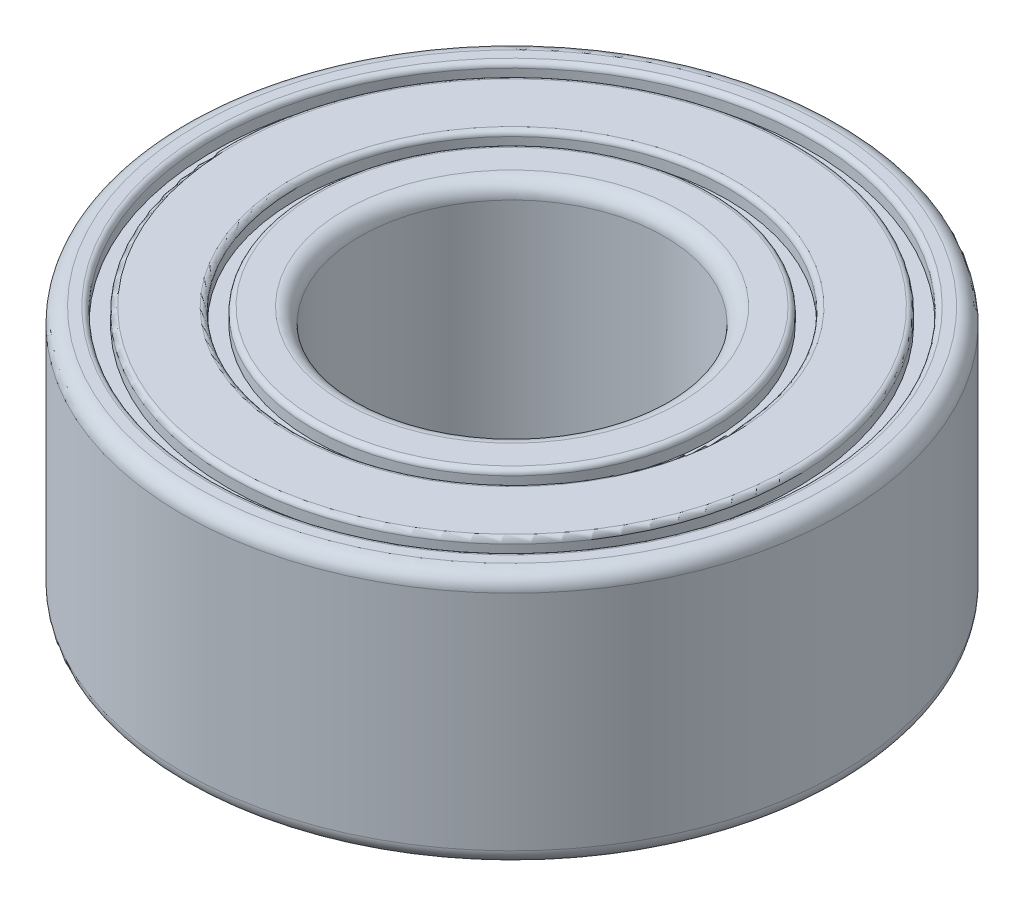
ISO-10303-21;
HEADER;
FILE_DESCRIPTION(('STEP AP214'),'2;1');
FILE_NAME('part.step','',(''),(''),'','','');
FILE_SCHEMA(('AUTOMOTIVE_DESIGN { 1 0 10303 214 1 1 1 1 }'));
ENDSEC;
DATA;
#1=APPLICATION_CONTEXT('core data for automotive mechanical design processes');
#2=APPLICATION_PROTOCOL_DEFINITION('international standard','automotive_design',2000,#1);
#3=PRODUCT_CONTEXT('',#1,'mechanical');
#4=PRODUCT('Part','Part','',(#3));
#5=PRODUCT_RELATED_PRODUCT_CATEGORY('part','',(#4));
#6=PRODUCT_DEFINITION_FORMATION('','',#4);
#7=PRODUCT_DEFINITION_CONTEXT('part definition',#1,'design');
#8=PRODUCT_DEFINITION('design','',#6,#7);
#9=PRODUCT_DEFINITION_SHAPE('','',#8);
#10=(LENGTH_UNIT() NAMED_UNIT(*) SI_UNIT(.MILLI.,.METRE.));
#11=(NAMED_UNIT(*) PLANE_ANGLE_UNIT() SI_UNIT($,.RADIAN.));
#12=(NAMED_UNIT(*) SI_UNIT($,.STERADIAN.) SOLID_ANGLE_UNIT());
#13=UNCERTAINTY_MEASURE_WITH_UNIT(LENGTH_MEASURE(1.E-05),#10,'distance_accuracy_value','');
#14=(GEOMETRIC_REPRESENTATION_CONTEXT(3) GLOBAL_UNCERTAINTY_ASSIGNED_CONTEXT((#13)) GLOBAL_UNIT_ASSIGNED_CONTEXT((#10,
#11,#12)) REPRESENTATION_CONTEXT('',''));
#15=CARTESIAN_POINT('',(0.,0.,0.));
#16=DIRECTION('',(0.,0.,1.));
#17=DIRECTION('',(1.,0.,0.));
#18=AXIS2_PLACEMENT_3D('',#15,#16,#17);
#19=CARTESIAN_POINT('',(0.,0.,0.));
#20=DIRECTION('',(0.,1.,0.));
#21=DIRECTION('',(0.,0.,1.));
#22=AXIS2_PLACEMENT_3D('',#19,#20,#21);
#23=PLANE('',#22);
#24=CARTESIAN_POINT('',(0.,0.,0.));
#25=DIRECTION('',(0.,1.,0.));
#26=DIRECTION('',(0.,0.,1.));
#27=AXIS2_PLACEMENT_3D('',#24,#25,#26);
#28=CIRCLE('',#27,3.3);
#29=CARTESIAN_POINT('',(0.,0.,3.3));
#30=VERTEX_POINT('',#29);
#31=EDGE_CURVE('E66',#30,#30,#28,.T.);
#32=ORIENTED_EDGE('',*,*,#31,.T.);
#33=EDGE_LOOP('',(#32));
#34=FACE_BOUND('',#33,.T.);
#35=CARTESIAN_POINT('',(0.,0.,0.));
#36=DIRECTION('',(0.,1.,0.));
#37=DIRECTION('',(0.,0.,1.));
#38=AXIS2_PLACEMENT_3D('',#35,#36,#37);
#39=CIRCLE('',#38,3.85);
#40=CARTESIAN_POINT('',(0.,0.,3.85));
#41=VERTEX_POINT('',#40);
#42=EDGE_CURVE('E90',#41,#41,#39,.F.);
#43=ORIENTED_EDGE('',*,*,#42,.T.);
#44=EDGE_LOOP('',(#43));
#45=FACE_BOUND('',#44,.T.);
#46=ADVANCED_FACE('F43',(#34,#45),#23,.F.);
#47=CARTESIAN_POINT('',(0.,0.,0.));
#48=DIRECTION('',(0.,1.,0.));
#49=DIRECTION('',(0.,0.,1.));
#50=AXIS2_PLACEMENT_3D('',#47,#48,#49);
#51=CIRCLE('',#50,5.5);
#52=CARTESIAN_POINT('',(0.,0.,5.5));
#53=VERTEX_POINT('',#52);
#54=EDGE_CURVE('E117',#53,#53,#51,.F.);
#55=ORIENTED_EDGE('',*,*,#54,.T.);
#56=EDGE_LOOP('',(#55));
#57=FACE_BOUND('',#56,.T.);
#58=CARTESIAN_POINT('',(0.,0.,0.));
#59=DIRECTION('',(0.,1.,0.));
#60=DIRECTION('',(0.,0.,1.));
#61=AXIS2_PLACEMENT_3D('',#58,#59,#60);
#62=CIRCLE('',#61,4.35);
#63=CARTESIAN_POINT('',(0.,0.,4.35));
#64=VERTEX_POINT('',#63);
#65=EDGE_CURVE('E120',#64,#64,#62,.T.);
#66=ORIENTED_EDGE('',*,*,#65,.T.);
#67=EDGE_LOOP('',(#66));
#68=FACE_BOUND('',#67,.T.);
#69=ADVANCED_FACE('F168',(#57,#68),#23,.F.);
#70=CARTESIAN_POINT('',(0.,5.,0.));
#71=DIRECTION('',(0.,1.,0.));
#72=DIRECTION('',(0.,0.,1.));
#73=AXIS2_PLACEMENT_3D('',#70,#71,#72);
#74=PLANE('',#73);
#75=CARTESIAN_POINT('',(0.,5.,0.));
#76=DIRECTION('',(0.,1.,0.));
#77=DIRECTION('',(0.,0.,1.));
#78=AXIS2_PLACEMENT_3D('',#75,#76,#77);
#79=CIRCLE('',#78,5.5);
#80=CARTESIAN_POINT('',(0.,5.,5.5));
#81=VERTEX_POINT('',#80);
#82=EDGE_CURVE('E105',#81,#81,#79,.T.);
#83=ORIENTED_EDGE('',*,*,#82,.T.);
#84=EDGE_LOOP('',(#83));
#85=FACE_BOUND('',#84,.T.);
#86=CARTESIAN_POINT('',(0.,5.,0.));
#87=DIRECTION('',(0.,1.,0.));
#88=DIRECTION('',(0.,0.,1.));
#89=AXIS2_PLACEMENT_3D('',#86,#87,#88);
#90=CIRCLE('',#89,4.35);
#91=CARTESIAN_POINT('',(0.,5.,4.35));
#92=VERTEX_POINT('',#91);
#93=EDGE_CURVE('E108',#92,#92,#90,.F.);
#94=ORIENTED_EDGE('',*,*,#93,.T.);
#95=EDGE_LOOP('',(#94));
#96=FACE_BOUND('',#95,.T.);
#97=ADVANCED_FACE('F175',(#85,#96),#74,.T.);
#98=CARTESIAN_POINT('',(0.,5.,0.));
#99=DIRECTION('',(0.,1.,0.));
#100=DIRECTION('',(0.,0.,1.));
#101=AXIS2_PLACEMENT_3D('',#98,#99,#100);
#102=CIRCLE('',#101,3.3);
#103=CARTESIAN_POINT('',(0.,5.,3.3));
#104=VERTEX_POINT('',#103);
#105=EDGE_CURVE('E63',#104,#104,#102,.F.);
#106=ORIENTED_EDGE('',*,*,#105,.T.);
#107=EDGE_LOOP('',(#106));
#108=FACE_BOUND('',#107,.T.);
#109=CARTESIAN_POINT('',(0.,5.,0.));
#110=DIRECTION('',(0.,1.,0.));
#111=DIRECTION('',(0.,0.,1.));
#112=AXIS2_PLACEMENT_3D('',#109,#110,#111);
#113=CIRCLE('',#112,3.85);
#114=CARTESIAN_POINT('',(0.,5.,3.85));
#115=VERTEX_POINT('',#114);
#116=EDGE_CURVE('E84',#115,#115,#113,.T.);
#117=ORIENTED_EDGE('',*,*,#116,.T.);
#118=EDGE_LOOP('',(#117));
#119=FACE_BOUND('',#118,.T.);
#120=ADVANCED_FACE('F191',(#108,#119),#74,.T.);
#121=CARTESIAN_POINT('',(0.,5.,0.));
#122=DIRECTION('',(0.,-1.,0.));
#123=DIRECTION('',(0.,0.,-1.));
#124=AXIS2_PLACEMENT_3D('',#121,#122,#123);
#125=CYLINDRICAL_SURFACE('',#124,6.5);
#126=CARTESIAN_POINT('',(0.,0.3,0.));
#127=DIRECTION('',(0.,1.,0.));
#128=DIRECTION('',(0.,0.,1.));
#129=AXIS2_PLACEMENT_3D('',#126,#127,#128);
#130=CIRCLE('',#129,6.5);
#131=CARTESIAN_POINT('',(0.,0.3,6.5));
#132=VERTEX_POINT('',#131);
#133=EDGE_CURVE('E54',#132,#132,#130,.T.);
#134=ORIENTED_EDGE('',*,*,#133,.T.);
#135=EDGE_LOOP('',(#134));
#136=FACE_BOUND('',#135,.T.);
#137=CARTESIAN_POINT('',(0.,4.7,0.));
#138=DIRECTION('',(0.,1.,0.));
#139=DIRECTION('',(0.,0.,1.));
#140=AXIS2_PLACEMENT_3D('',#137,#138,#139);
#141=CIRCLE('',#140,6.5);
#142=CARTESIAN_POINT('',(0.,4.7,6.5));
#143=VERTEX_POINT('',#142);
#144=EDGE_CURVE('E58',#143,#143,#141,.F.);
#145=ORIENTED_EDGE('',*,*,#144,.T.);
#146=EDGE_LOOP('',(#145));
#147=FACE_BOUND('',#146,.T.);
#148=ADVANCED_FACE('F190',(#136,#147),#125,.T.);
#149=CARTESIAN_POINT('',(0.,5.,0.));
#150=DIRECTION('',(0.,1.,0.));
#151=DIRECTION('',(0.,0.,1.));
#152=AXIS2_PLACEMENT_3D('',#149,#150,#151);
#153=CIRCLE('',#152,6.2);
#154=CARTESIAN_POINT('',(0.,5.,6.2));
#155=VERTEX_POINT('',#154);
#156=EDGE_CURVE('E11',#155,#155,#153,.T.);
#157=ORIENTED_EDGE('',*,*,#156,.T.);
#158=EDGE_LOOP('',(#157));
#159=FACE_BOUND('',#158,.T.);
#160=CARTESIAN_POINT('',(0.,5.,0.));
#161=DIRECTION('',(0.,1.,0.));
#162=DIRECTION('',(0.,0.,1.));
#163=AXIS2_PLACEMENT_3D('',#160,#161,#162);
#164=CIRCLE('',#163,6.);
#165=CARTESIAN_POINT('',(0.,5.,6.));
#166=VERTEX_POINT('',#165);
#167=EDGE_CURVE('E75',#166,#166,#164,.F.);
#168=ORIENTED_EDGE('',*,*,#167,.T.);
#169=EDGE_LOOP('',(#168));
#170=FACE_BOUND('',#169,.T.);
#171=ADVANCED_FACE('F182',(#159,#170),#74,.T.);
#172=CARTESIAN_POINT('',(0.,0.,0.));
#173=DIRECTION('',(0.,1.,0.));
#174=DIRECTION('',(0.,0.,1.));
#175=AXIS2_PLACEMENT_3D('',#172,#173,#174);
#176=CIRCLE('',#175,6.2);
#177=CARTESIAN_POINT('',(0.,0.,6.2));
#178=VERTEX_POINT('',#177);
#179=EDGE_CURVE('E50',#178,#178,#176,.F.);
#180=ORIENTED_EDGE('',*,*,#179,.T.);
#181=EDGE_LOOP('',(#180));
#182=FACE_BOUND('',#181,.T.);
#183=CARTESIAN_POINT('',(0.,0.,0.));
#184=DIRECTION('',(0.,1.,0.));
#185=DIRECTION('',(0.,0.,1.));
#186=AXIS2_PLACEMENT_3D('',#183,#184,#185);
#187=CIRCLE('',#186,6.);
#188=CARTESIAN_POINT('',(0.,0.,6.));
#189=VERTEX_POINT('',#188);
#190=EDGE_CURVE('E93',#189,#189,#187,.T.);
#191=ORIENTED_EDGE('',*,*,#190,.T.);
#192=EDGE_LOOP('',(#191));
#193=FACE_BOUND('',#192,.T.);
#194=ADVANCED_FACE('F171',(#182,#193),#23,.F.);
#195=CARTESIAN_POINT('',(0.,-0.00100000000000013,0.));
#196=DIRECTION('',(0.,1.,0.));
#197=DIRECTION('',(0.,0.,1.));
#198=AXIS2_PLACEMENT_3D('',#195,#196,#197);
#199=CYLINDRICAL_SURFACE('',#198,3.);
#200=CARTESIAN_POINT('',(0.,0.3,0.));
#201=DIRECTION('',(0.,1.,0.));
#202=DIRECTION('',(0.,0.,1.));
#203=AXIS2_PLACEMENT_3D('',#200,#201,#202);
#204=CIRCLE('',#203,3.);
#205=CARTESIAN_POINT('',(0.,0.3,3.));
#206=VERTEX_POINT('',#205);
#207=EDGE_CURVE('E69',#206,#206,#204,.F.);
#208=ORIENTED_EDGE('',*,*,#207,.T.);
#209=EDGE_LOOP('',(#208));
#210=FACE_BOUND('',#209,.T.);
#211=CARTESIAN_POINT('',(0.,4.7,0.));
#212=DIRECTION('',(0.,1.,0.));
#213=DIRECTION('',(0.,0.,1.));
#214=AXIS2_PLACEMENT_3D('',#211,#212,#213);
#215=CIRCLE('',#214,3.);
#216=CARTESIAN_POINT('',(0.,4.7,3.));
#217=VERTEX_POINT('',#216);
#218=EDGE_CURVE('E72',#217,#217,#215,.T.);
#219=ORIENTED_EDGE('',*,*,#218,.T.);
#220=EDGE_LOOP('',(#219));
#221=FACE_BOUND('',#220,.T.);
#222=ADVANCED_FACE('F181',(#210,#221),#199,.F.);
#223=CARTESIAN_POINT('',(0.,4.7,0.));
#224=DIRECTION('',(0.,1.,0.));
#225=DIRECTION('',(0.,0.,1.));
#226=AXIS2_PLACEMENT_3D('',#223,#224,#225);
#227=CYLINDRICAL_SURFACE('',#226,3.95);
#228=CARTESIAN_POINT('',(0.,4.9,0.));
#229=DIRECTION('',(0.,1.,0.));
#230=DIRECTION('',(0.,0.,1.));
#231=AXIS2_PLACEMENT_3D('',#228,#229,#230);
#232=CIRCLE('',#231,3.95);
#233=CARTESIAN_POINT('',(0.,4.9,3.95));
#234=VERTEX_POINT('',#233);
#235=EDGE_CURVE('E81',#234,#234,#232,.F.);
#236=ORIENTED_EDGE('',*,*,#235,.T.);
#237=EDGE_LOOP('',(#236));
#238=FACE_BOUND('',#237,.T.);
#239=CARTESIAN_POINT('',(0.,4.7,0.));
#240=DIRECTION('',(0.,1.,0.));
#241=DIRECTION('',(0.,0.,1.));
#242=AXIS2_PLACEMENT_3D('',#239,#240,#241);
#243=CIRCLE('',#242,3.95);
#244=CARTESIAN_POINT('',(0.,4.7,3.95));
#245=VERTEX_POINT('',#244);
#246=EDGE_CURVE('E126',#245,#245,#243,.T.);
#247=ORIENTED_EDGE('',*,*,#246,.T.);
#248=EDGE_LOOP('',(#247));
#249=FACE_BOUND('',#248,.T.);
#250=ADVANCED_FACE('F187',(#238,#249),#227,.T.);
#251=CARTESIAN_POINT('',(0.,4.7,0.));
#252=DIRECTION('',(0.,1.,0.));
#253=DIRECTION('',(0.,0.,1.));
#254=AXIS2_PLACEMENT_3D('',#251,#252,#253);
#255=CYLINDRICAL_SURFACE('',#254,4.25);
#256=CARTESIAN_POINT('',(0.,4.9,0.));
#257=DIRECTION('',(0.,1.,0.));
#258=DIRECTION('',(0.,0.,1.));
#259=AXIS2_PLACEMENT_3D('',#256,#257,#258);
#260=CIRCLE('',#259,4.25);
#261=CARTESIAN_POINT('',(0.,4.9,4.25));
#262=VERTEX_POINT('',#261);
#263=EDGE_CURVE('E99',#262,#262,#260,.T.);
#264=ORIENTED_EDGE('',*,*,#263,.T.);
#265=EDGE_LOOP('',(#264));
#266=FACE_BOUND('',#265,.T.);
#267=CARTESIAN_POINT('',(0.,4.7,0.));
#268=DIRECTION('',(0.,1.,0.));
#269=DIRECTION('',(0.,0.,1.));
#270=AXIS2_PLACEMENT_3D('',#267,#268,#269);
#271=CIRCLE('',#270,4.25);
#272=CARTESIAN_POINT('',(0.,4.7,4.25));
#273=VERTEX_POINT('',#272);
#274=EDGE_CURVE('E123',#273,#273,#271,.T.);
#275=ORIENTED_EDGE('',*,*,#274,.F.);
#276=EDGE_LOOP('',(#275));
#277=FACE_BOUND('',#276,.T.);
#278=ADVANCED_FACE('F235',(#266,#277),#255,.F.);
#279=CARTESIAN_POINT('',(0.,4.7,0.));
#280=DIRECTION('',(0.,1.,0.));
#281=DIRECTION('',(0.,0.,1.));
#282=AXIS2_PLACEMENT_3D('',#279,#280,#281);
#283=PLANE('',#282);
#284=ORIENTED_EDGE('',*,*,#246,.F.);
#285=EDGE_LOOP('',(#284));
#286=FACE_BOUND('',#285,.T.);
#287=ORIENTED_EDGE('',*,*,#274,.T.);
#288=EDGE_LOOP('',(#287));
#289=FACE_BOUND('',#288,.T.);
#290=ADVANCED_FACE('F231',(#286,#289),#283,.T.);
#291=CARTESIAN_POINT('',(0.,4.7,0.));
#292=DIRECTION('',(0.,1.,0.));
#293=DIRECTION('',(0.,0.,1.));
#294=AXIS2_PLACEMENT_3D('',#291,#292,#293);
#295=CYLINDRICAL_SURFACE('',#294,5.6);
#296=CARTESIAN_POINT('',(0.,4.9,0.));
#297=DIRECTION('',(0.,1.,0.));
#298=DIRECTION('',(0.,0.,1.));
#299=AXIS2_PLACEMENT_3D('',#296,#297,#298);
#300=CIRCLE('',#299,5.6);
#301=CARTESIAN_POINT('',(0.,4.9,5.6));
#302=VERTEX_POINT('',#301);
#303=EDGE_CURVE('E102',#302,#302,#300,.F.);
#304=ORIENTED_EDGE('',*,*,#303,.T.);
#305=EDGE_LOOP('',(#304));
#306=FACE_BOUND('',#305,.T.);
#307=CARTESIAN_POINT('',(0.,4.7,0.));
#308=DIRECTION('',(0.,1.,0.));
#309=DIRECTION('',(0.,0.,1.));
#310=AXIS2_PLACEMENT_3D('',#307,#308,#309);
#311=CIRCLE('',#310,5.6);
#312=CARTESIAN_POINT('',(0.,4.7,5.6));
#313=VERTEX_POINT('',#312);
#314=EDGE_CURVE('E132',#313,#313,#311,.T.);
#315=ORIENTED_EDGE('',*,*,#314,.T.);
#316=EDGE_LOOP('',(#315));
#317=FACE_BOUND('',#316,.T.);
#318=ADVANCED_FACE('F227',(#306,#317),#295,.T.);
#319=CARTESIAN_POINT('',(0.,4.7,0.));
#320=DIRECTION('',(0.,1.,0.));
#321=DIRECTION('',(0.,0.,1.));
#322=AXIS2_PLACEMENT_3D('',#319,#320,#321);
#323=CYLINDRICAL_SURFACE('',#322,5.9);
#324=CARTESIAN_POINT('',(0.,4.9,0.));
#325=DIRECTION('',(0.,1.,0.));
#326=DIRECTION('',(0.,0.,1.));
#327=AXIS2_PLACEMENT_3D('',#324,#325,#326);
#328=CIRCLE('',#327,5.9);
#329=CARTESIAN_POINT('',(0.,4.9,5.9));
#330=VERTEX_POINT('',#329);
#331=EDGE_CURVE('E78',#330,#330,#328,.T.);
#332=ORIENTED_EDGE('',*,*,#331,.T.);
#333=EDGE_LOOP('',(#332));
#334=FACE_BOUND('',#333,.T.);
#335=CARTESIAN_POINT('',(0.,4.7,0.));
#336=DIRECTION('',(0.,1.,0.));
#337=DIRECTION('',(0.,0.,1.));
#338=AXIS2_PLACEMENT_3D('',#335,#336,#337);
#339=CIRCLE('',#338,5.9);
#340=CARTESIAN_POINT('',(0.,4.7,5.9));
#341=VERTEX_POINT('',#340);
#342=EDGE_CURVE('E129',#341,#341,#339,.T.);
#343=ORIENTED_EDGE('',*,*,#342,.F.);
#344=EDGE_LOOP('',(#343));
#345=FACE_BOUND('',#344,.T.);
#346=ADVANCED_FACE('F223',(#334,#345),#323,.F.);
#347=CARTESIAN_POINT('',(0.,4.7,0.));
#348=DIRECTION('',(0.,1.,0.));
#349=DIRECTION('',(0.,0.,1.));
#350=AXIS2_PLACEMENT_3D('',#347,#348,#349);
#351=PLANE('',#350);
#352=ORIENTED_EDGE('',*,*,#314,.F.);
#353=EDGE_LOOP('',(#352));
#354=FACE_BOUND('',#353,.T.);
#355=ORIENTED_EDGE('',*,*,#342,.T.);
#356=EDGE_LOOP('',(#355));
#357=FACE_BOUND('',#356,.T.);
#358=ADVANCED_FACE('F219',(#354,#357),#351,.T.);
#359=CARTESIAN_POINT('',(0.,0.3,0.));
#360=DIRECTION('',(0.,-1.,0.));
#361=DIRECTION('',(0.,0.,-1.));
#362=AXIS2_PLACEMENT_3D('',#359,#360,#361);
#363=CYLINDRICAL_SURFACE('',#362,5.6);
#364=CARTESIAN_POINT('',(0.,0.1,0.));
#365=DIRECTION('',(0.,1.,0.));
#366=DIRECTION('',(0.,0.,1.));
#367=AXIS2_PLACEMENT_3D('',#364,#365,#366);
#368=CIRCLE('',#367,5.6);
#369=CARTESIAN_POINT('',(0.,0.1,5.6));
#370=VERTEX_POINT('',#369);
#371=EDGE_CURVE('E114',#370,#370,#368,.T.);
#372=ORIENTED_EDGE('',*,*,#371,.T.);
#373=EDGE_LOOP('',(#372));
#374=FACE_BOUND('',#373,.T.);
#375=CARTESIAN_POINT('',(0.,0.3,0.));
#376=DIRECTION('',(0.,-1.,0.));
#377=DIRECTION('',(0.,0.,-1.));
#378=AXIS2_PLACEMENT_3D('',#375,#376,#377);
#379=CIRCLE('',#378,5.6);
#380=CARTESIAN_POINT('',(0.,0.3,-5.6));
#381=VERTEX_POINT('',#380);
#382=EDGE_CURVE('E138',#381,#381,#379,.T.);
#383=ORIENTED_EDGE('',*,*,#382,.T.);
#384=EDGE_LOOP('',(#383));
#385=FACE_BOUND('',#384,.T.);
#386=ADVANCED_FACE('F206',(#374,#385),#363,.T.);
#387=CARTESIAN_POINT('',(0.,0.3,0.));
#388=DIRECTION('',(0.,-1.,0.));
#389=DIRECTION('',(0.,0.,-1.));
#390=AXIS2_PLACEMENT_3D('',#387,#388,#389);
#391=CYLINDRICAL_SURFACE('',#390,5.9);
#392=CARTESIAN_POINT('',(0.,0.1,0.));
#393=DIRECTION('',(0.,1.,0.));
#394=DIRECTION('',(0.,0.,1.));
#395=AXIS2_PLACEMENT_3D('',#392,#393,#394);
#396=CIRCLE('',#395,5.9);
#397=CARTESIAN_POINT('',(0.,0.1,5.9));
#398=VERTEX_POINT('',#397);
#399=EDGE_CURVE('E96',#398,#398,#396,.F.);
#400=ORIENTED_EDGE('',*,*,#399,.T.);
#401=EDGE_LOOP('',(#400));
#402=FACE_BOUND('',#401,.T.);
#403=CARTESIAN_POINT('',(0.,0.3,0.));
#404=DIRECTION('',(0.,-1.,0.));
#405=DIRECTION('',(0.,0.,-1.));
#406=AXIS2_PLACEMENT_3D('',#403,#404,#405);
#407=CIRCLE('',#406,5.9);
#408=CARTESIAN_POINT('',(0.,0.3,-5.9));
#409=VERTEX_POINT('',#408);
#410=EDGE_CURVE('E135',#409,#409,#407,.T.);
#411=ORIENTED_EDGE('',*,*,#410,.F.);
#412=EDGE_LOOP('',(#411));
#413=FACE_BOUND('',#412,.T.);
#414=ADVANCED_FACE('F203',(#402,#413),#391,.F.);
#415=CARTESIAN_POINT('',(0.,0.3,0.));
#416=DIRECTION('',(0.,-1.,0.));
#417=DIRECTION('',(0.,0.,-1.));
#418=AXIS2_PLACEMENT_3D('',#415,#416,#417);
#419=PLANE('',#418);
#420=ORIENTED_EDGE('',*,*,#382,.F.);
#421=EDGE_LOOP('',(#420));
#422=FACE_BOUND('',#421,.T.);
#423=ORIENTED_EDGE('',*,*,#410,.T.);
#424=EDGE_LOOP('',(#423));
#425=FACE_BOUND('',#424,.T.);
#426=ADVANCED_FACE('F164',(#422,#425),#419,.T.);
#427=CARTESIAN_POINT('',(0.,0.3,0.));
#428=DIRECTION('',(0.,-1.,0.));
#429=DIRECTION('',(0.,0.,-1.));
#430=AXIS2_PLACEMENT_3D('',#427,#428,#429);
#431=CYLINDRICAL_SURFACE('',#430,3.95);
#432=CARTESIAN_POINT('',(0.,0.1,0.));
#433=DIRECTION('',(0.,1.,0.));
#434=DIRECTION('',(0.,0.,1.));
#435=AXIS2_PLACEMENT_3D('',#432,#433,#434);
#436=CIRCLE('',#435,3.95);
#437=CARTESIAN_POINT('',(0.,0.1,3.95));
#438=VERTEX_POINT('',#437);
#439=EDGE_CURVE('E87',#438,#438,#436,.T.);
#440=ORIENTED_EDGE('',*,*,#439,.T.);
#441=EDGE_LOOP('',(#440));
#442=FACE_BOUND('',#441,.T.);
#443=CARTESIAN_POINT('',(0.,0.3,0.));
#444=DIRECTION('',(0.,-1.,0.));
#445=DIRECTION('',(0.,0.,-1.));
#446=AXIS2_PLACEMENT_3D('',#443,#444,#445);
#447=CIRCLE('',#446,3.95);
#448=CARTESIAN_POINT('',(0.,0.3,-3.95));
#449=VERTEX_POINT('',#448);
#450=EDGE_CURVE('E144',#449,#449,#447,.T.);
#451=ORIENTED_EDGE('',*,*,#450,.T.);
#452=EDGE_LOOP('',(#451));
#453=FACE_BOUND('',#452,.T.);
#454=ADVANCED_FACE('F148',(#442,#453),#431,.T.);
#455=CARTESIAN_POINT('',(0.,0.3,0.));
#456=DIRECTION('',(0.,-1.,0.));
#457=DIRECTION('',(0.,0.,-1.));
#458=AXIS2_PLACEMENT_3D('',#455,#456,#457);
#459=CYLINDRICAL_SURFACE('',#458,4.25);
#460=CARTESIAN_POINT('',(0.,0.1,0.));
#461=DIRECTION('',(0.,1.,0.));
#462=DIRECTION('',(0.,0.,1.));
#463=AXIS2_PLACEMENT_3D('',#460,#461,#462);
#464=CIRCLE('',#463,4.25);
#465=CARTESIAN_POINT('',(0.,0.1,4.25));
#466=VERTEX_POINT('',#465);
#467=EDGE_CURVE('E111',#466,#466,#464,.F.);
#468=ORIENTED_EDGE('',*,*,#467,.T.);
#469=EDGE_LOOP('',(#468));
#470=FACE_BOUND('',#469,.T.);
#471=CARTESIAN_POINT('',(0.,0.3,0.));
#472=DIRECTION('',(0.,-1.,0.));
#473=DIRECTION('',(0.,0.,-1.));
#474=AXIS2_PLACEMENT_3D('',#471,#472,#473);
#475=CIRCLE('',#474,4.25);
#476=CARTESIAN_POINT('',(0.,0.3,-4.25));
#477=VERTEX_POINT('',#476);
#478=EDGE_CURVE('E141',#477,#477,#475,.T.);
#479=ORIENTED_EDGE('',*,*,#478,.F.);
#480=EDGE_LOOP('',(#479));
#481=FACE_BOUND('',#480,.T.);
#482=ADVANCED_FACE('F154',(#470,#481),#459,.F.);
#483=CARTESIAN_POINT('',(0.,0.3,0.));
#484=DIRECTION('',(0.,-1.,0.));
#485=DIRECTION('',(0.,0.,-1.));
#486=AXIS2_PLACEMENT_3D('',#483,#484,#485);
#487=PLANE('',#486);
#488=ORIENTED_EDGE('',*,*,#450,.F.);
#489=EDGE_LOOP('',(#488));
#490=FACE_BOUND('',#489,.T.);
#491=ORIENTED_EDGE('',*,*,#478,.T.);
#492=EDGE_LOOP('',(#491));
#493=FACE_BOUND('',#492,.T.);
#494=ADVANCED_FACE('F150',(#490,#493),#487,.T.);
#495=CARTESIAN_POINT('',(0.,0.1,0.));
#496=DIRECTION('',(0.,1.,0.));
#497=DIRECTION('',(0.,0.,1.));
#498=AXIS2_PLACEMENT_3D('',#495,#496,#497);
#499=TOROIDAL_SURFACE('',#498,5.5,0.1);
#500=ORIENTED_EDGE('',*,*,#371,.F.);
#501=EDGE_LOOP('',(#500));
#502=FACE_BOUND('',#501,.T.);
#503=ORIENTED_EDGE('',*,*,#54,.F.);
#504=EDGE_LOOP('',(#503));
#505=FACE_BOUND('',#504,.T.);
#506=ADVANCED_FACE('F153',(#502,#505),#499,.T.);
#507=CARTESIAN_POINT('',(0.,0.1,0.));
#508=DIRECTION('',(0.,1.,0.));
#509=DIRECTION('',(0.,0.,1.));
#510=AXIS2_PLACEMENT_3D('',#507,#508,#509);
#511=TOROIDAL_SURFACE('',#510,4.35,0.1);
#512=ORIENTED_EDGE('',*,*,#65,.F.);
#513=EDGE_LOOP('',(#512));
#514=FACE_BOUND('',#513,.T.);
#515=ORIENTED_EDGE('',*,*,#467,.F.);
#516=EDGE_LOOP('',(#515));
#517=FACE_BOUND('',#516,.T.);
#518=ADVANCED_FACE('F296',(#514,#517),#511,.T.);
#519=CARTESIAN_POINT('',(0.,4.9,0.));
#520=DIRECTION('',(0.,1.,0.));
#521=DIRECTION('',(0.,0.,1.));
#522=AXIS2_PLACEMENT_3D('',#519,#520,#521);
#523=TOROIDAL_SURFACE('',#522,5.5,0.1);
#524=ORIENTED_EDGE('',*,*,#303,.F.);
#525=EDGE_LOOP('',(#524));
#526=FACE_BOUND('',#525,.T.);
#527=ORIENTED_EDGE('',*,*,#82,.F.);
#528=EDGE_LOOP('',(#527));
#529=FACE_BOUND('',#528,.T.);
#530=ADVANCED_FACE('F292',(#526,#529),#523,.T.);
#531=CARTESIAN_POINT('',(0.,4.9,0.));
#532=DIRECTION('',(0.,1.,0.));
#533=DIRECTION('',(0.,0.,1.));
#534=AXIS2_PLACEMENT_3D('',#531,#532,#533);
#535=TOROIDAL_SURFACE('',#534,4.35,0.1);
#536=ORIENTED_EDGE('',*,*,#93,.F.);
#537=EDGE_LOOP('',(#536));
#538=FACE_BOUND('',#537,.T.);
#539=ORIENTED_EDGE('',*,*,#263,.F.);
#540=EDGE_LOOP('',(#539));
#541=FACE_BOUND('',#540,.T.);
#542=ADVANCED_FACE('F199',(#538,#541),#535,.T.);
#543=CARTESIAN_POINT('',(0.,0.1,0.));
#544=DIRECTION('',(0.,1.,0.));
#545=DIRECTION('',(0.,0.,1.));
#546=AXIS2_PLACEMENT_3D('',#543,#544,#545);
#547=TOROIDAL_SURFACE('',#546,6.,0.1);
#548=ORIENTED_EDGE('',*,*,#190,.F.);
#549=EDGE_LOOP('',(#548));
#550=FACE_BOUND('',#549,.T.);
#551=ORIENTED_EDGE('',*,*,#399,.F.);
#552=EDGE_LOOP('',(#551));
#553=FACE_BOUND('',#552,.T.);
#554=ADVANCED_FACE('F195',(#550,#553),#547,.T.);
#555=CARTESIAN_POINT('',(0.,0.1,0.));
#556=DIRECTION('',(0.,1.,0.));
#557=DIRECTION('',(0.,0.,1.));
#558=AXIS2_PLACEMENT_3D('',#555,#556,#557);
#559=TOROIDAL_SURFACE('',#558,3.85,0.1);
#560=ORIENTED_EDGE('',*,*,#439,.F.);
#561=EDGE_LOOP('',(#560));
#562=FACE_BOUND('',#561,.T.);
#563=ORIENTED_EDGE('',*,*,#42,.F.);
#564=EDGE_LOOP('',(#563));
#565=FACE_BOUND('',#564,.T.);
#566=ADVANCED_FACE('F198',(#562,#565),#559,.T.);
#567=CARTESIAN_POINT('',(0.,4.9,0.));
#568=DIRECTION('',(0.,1.,0.));
#569=DIRECTION('',(0.,0.,1.));
#570=AXIS2_PLACEMENT_3D('',#567,#568,#569);
#571=TOROIDAL_SURFACE('',#570,3.85,0.1);
#572=ORIENTED_EDGE('',*,*,#235,.F.);
#573=EDGE_LOOP('',(#572));
#574=FACE_BOUND('',#573,.T.);
#575=ORIENTED_EDGE('',*,*,#116,.F.);
#576=EDGE_LOOP('',(#575));
#577=FACE_BOUND('',#576,.T.);
#578=ADVANCED_FACE('F251',(#574,#577),#571,.T.);
#579=CARTESIAN_POINT('',(0.,4.9,0.));
#580=DIRECTION('',(0.,1.,0.));
#581=DIRECTION('',(0.,0.,1.));
#582=AXIS2_PLACEMENT_3D('',#579,#580,#581);
#583=TOROIDAL_SURFACE('',#582,6.,0.1);
#584=ORIENTED_EDGE('',*,*,#167,.F.);
#585=EDGE_LOOP('',(#584));
#586=FACE_BOUND('',#585,.T.);
#587=ORIENTED_EDGE('',*,*,#331,.F.);
#588=EDGE_LOOP('',(#587));
#589=FACE_BOUND('',#588,.T.);
#590=ADVANCED_FACE('F254',(#586,#589),#583,.T.);
#591=CARTESIAN_POINT('',(0.,0.3,0.));
#592=DIRECTION('',(0.,1.,0.));
#593=DIRECTION('',(0.,0.,1.));
#594=AXIS2_PLACEMENT_3D('',#591,#592,#593);
#595=TOROIDAL_SURFACE('',#594,3.3,0.3);
#596=ORIENTED_EDGE('',*,*,#31,.F.);
#597=EDGE_LOOP('',(#596));
#598=FACE_BOUND('',#597,.T.);
#599=ORIENTED_EDGE('',*,*,#207,.F.);
#600=EDGE_LOOP('',(#599));
#601=FACE_BOUND('',#600,.T.);
#602=ADVANCED_FACE('F272',(#598,#601),#595,.T.);
#603=CARTESIAN_POINT('',(0.,4.7,0.));
#604=DIRECTION('',(0.,1.,0.));
#605=DIRECTION('',(0.,0.,1.));
#606=AXIS2_PLACEMENT_3D('',#603,#604,#605);
#607=TOROIDAL_SURFACE('',#606,3.3,0.3);
#608=ORIENTED_EDGE('',*,*,#105,.F.);
#609=EDGE_LOOP('',(#608));
#610=FACE_BOUND('',#609,.T.);
#611=ORIENTED_EDGE('',*,*,#218,.F.);
#612=EDGE_LOOP('',(#611));
#613=FACE_BOUND('',#612,.T.);
#614=ADVANCED_FACE('F268',(#610,#613),#607,.T.);
#615=CARTESIAN_POINT('',(0.,0.3,0.));
#616=DIRECTION('',(0.,1.,0.));
#617=DIRECTION('',(0.,0.,1.));
#618=AXIS2_PLACEMENT_3D('',#615,#616,#617);
#619=TOROIDAL_SURFACE('',#618,6.2,0.3);
#620=ORIENTED_EDGE('',*,*,#179,.F.);
#621=EDGE_LOOP('',(#620));
#622=FACE_BOUND('',#621,.T.);
#623=ORIENTED_EDGE('',*,*,#133,.F.);
#624=EDGE_LOOP('',(#623));
#625=FACE_BOUND('',#624,.T.);
#626=ADVANCED_FACE('F271',(#622,#625),#619,.T.);
#627=CARTESIAN_POINT('',(0.,4.7,0.));
#628=DIRECTION('',(0.,1.,0.));
#629=DIRECTION('',(0.,0.,1.));
#630=AXIS2_PLACEMENT_3D('',#627,#628,#629);
#631=TOROIDAL_SURFACE('',#630,6.2,0.3);
#632=ORIENTED_EDGE('',*,*,#144,.F.);
#633=EDGE_LOOP('',(#632));
#634=FACE_BOUND('',#633,.T.);
#635=ORIENTED_EDGE('',*,*,#156,.F.);
#636=EDGE_LOOP('',(#635));
#637=FACE_BOUND('',#636,.T.);
#638=ADVANCED_FACE('F45',(#634,#637),#631,.T.);
#639=CLOSED_SHELL('',(#46,#69,#97,#120,#148,#171,#194,#222,#250,#278,#290,#318,#346,#358,#386,
#414,#426,#454,#482,#494,#506,#518,#530,#542,#554,#566,#578,#590,#602,#614,#626,#638));
#640=MANIFOLD_SOLID_BREP('B2',#639);
#641=ADVANCED_BREP_SHAPE_REPRESENTATION('',(#18,#640),#14);
#642=SHAPE_DEFINITION_REPRESENTATION(#9,#641);
ENDSEC;
END-ISO-10303-21;
